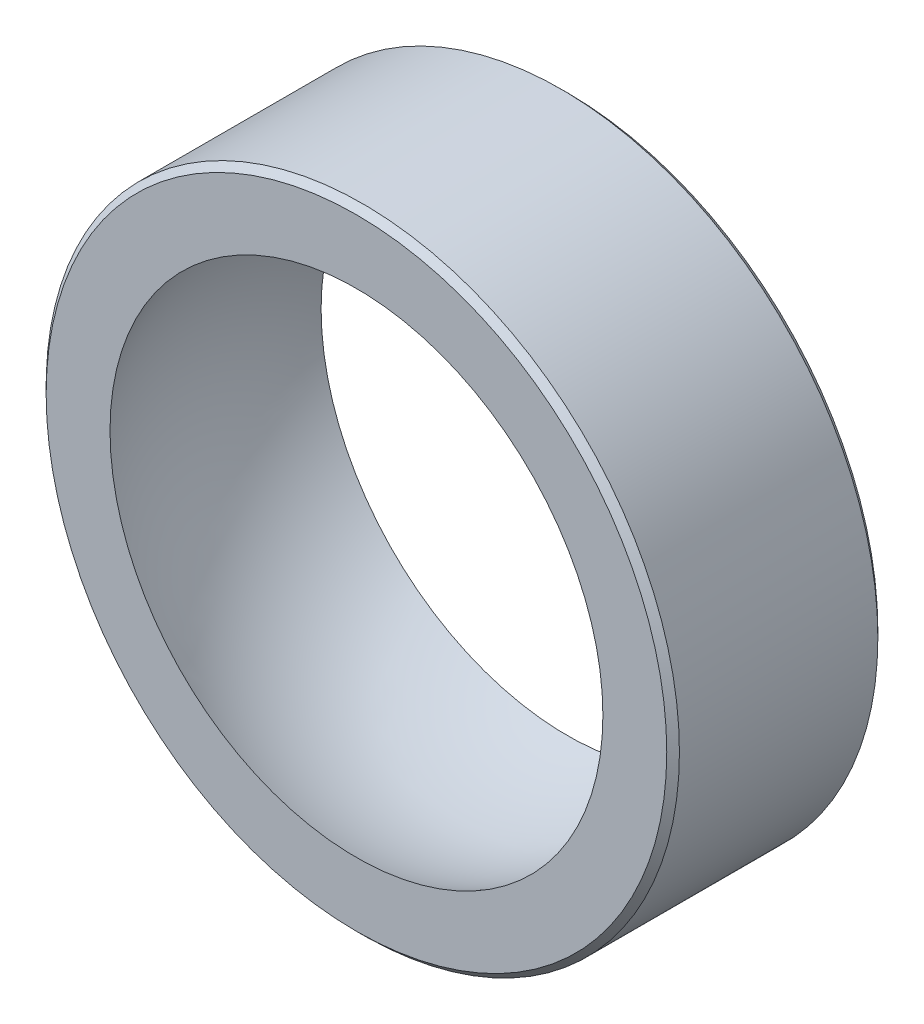
ISO-10303-21;
HEADER;
FILE_DESCRIPTION(('STEP AP214'),'2;1');
FILE_NAME('part.step','',(''),(''),'','','');
FILE_SCHEMA(('AUTOMOTIVE_DESIGN { 1 0 10303 214 1 1 1 1 }'));
ENDSEC;
DATA;
#1=APPLICATION_CONTEXT('core data for automotive mechanical design processes');
#2=APPLICATION_PROTOCOL_DEFINITION('international standard','automotive_design',2000,#1);
#3=PRODUCT_CONTEXT('',#1,'mechanical');
#4=PRODUCT('Part','Part','',(#3));
#5=PRODUCT_RELATED_PRODUCT_CATEGORY('part','',(#4));
#6=PRODUCT_DEFINITION_FORMATION('','',#4);
#7=PRODUCT_DEFINITION_CONTEXT('part definition',#1,'design');
#8=PRODUCT_DEFINITION('design','',#6,#7);
#9=PRODUCT_DEFINITION_SHAPE('','',#8);
#10=(LENGTH_UNIT() NAMED_UNIT(*) SI_UNIT(.MILLI.,.METRE.));
#11=(NAMED_UNIT(*) PLANE_ANGLE_UNIT() SI_UNIT($,.RADIAN.));
#12=(NAMED_UNIT(*) SI_UNIT($,.STERADIAN.) SOLID_ANGLE_UNIT());
#13=UNCERTAINTY_MEASURE_WITH_UNIT(LENGTH_MEASURE(1.E-05),#10,'distance_accuracy_value','');
#14=(GEOMETRIC_REPRESENTATION_CONTEXT(3) GLOBAL_UNCERTAINTY_ASSIGNED_CONTEXT((#13)) GLOBAL_UNIT_ASSIGNED_CONTEXT((#10,
#11,#12)) REPRESENTATION_CONTEXT('',''));
#15=CARTESIAN_POINT('',(0.,0.,0.));
#16=DIRECTION('',(0.,0.,1.));
#17=DIRECTION('',(1.,0.,0.));
#18=AXIS2_PLACEMENT_3D('',#15,#16,#17);
#19=CARTESIAN_POINT('',(0.,0.,-5.));
#20=DIRECTION('',(0.,0.,1.));
#21=DIRECTION('',(1.,0.,0.));
#22=AXIS2_PLACEMENT_3D('',#19,#20,#21);
#23=CYLINDRICAL_SURFACE('',#22,15.);
#24=CARTESIAN_POINT('',(0.,0.,-4.7));
#25=DIRECTION('',(0.,0.,1.));
#26=DIRECTION('',(1.,0.,0.));
#27=AXIS2_PLACEMENT_3D('',#24,#25,#26);
#28=CIRCLE('',#27,15.);
#29=CARTESIAN_POINT('',(15.,0.,-4.7));
#30=VERTEX_POINT('',#29);
#31=EDGE_CURVE('E49',#30,#30,#28,.T.);
#32=ORIENTED_EDGE('',*,*,#31,.T.);
#33=EDGE_LOOP('',(#32));
#34=FACE_BOUND('',#33,.T.);
#35=CARTESIAN_POINT('',(0.,0.,4.69999999999999));
#36=DIRECTION('',(0.,0.,1.));
#37=DIRECTION('',(1.,0.,0.));
#38=AXIS2_PLACEMENT_3D('',#35,#36,#37);
#39=CIRCLE('',#38,15.);
#40=CARTESIAN_POINT('',(15.,0.,4.69999999999999));
#41=VERTEX_POINT('',#40);
#42=EDGE_CURVE('E53',#41,#41,#39,.F.);
#43=ORIENTED_EDGE('',*,*,#42,.T.);
#44=EDGE_LOOP('',(#43));
#45=FACE_BOUND('',#44,.T.);
#46=ADVANCED_FACE('F38',(#34,#45),#23,.T.);
#47=CARTESIAN_POINT('',(0.,0.,-5.));
#48=DIRECTION('',(0.,0.,1.));
#49=DIRECTION('',(1.,0.,0.));
#50=AXIS2_PLACEMENT_3D('',#47,#48,#49);
#51=PLANE('',#50);
#52=CARTESIAN_POINT('',(0.,0.,-5.));
#53=DIRECTION('',(0.,0.,1.));
#54=DIRECTION('',(1.,0.,0.));
#55=AXIS2_PLACEMENT_3D('',#52,#53,#54);
#56=CIRCLE('',#55,11.6743308159397);
#57=CARTESIAN_POINT('',(11.6743308159397,0.,-5.));
#58=VERTEX_POINT('',#57);
#59=EDGE_CURVE('E58',#58,#58,#56,.T.);
#60=ORIENTED_EDGE('',*,*,#59,.T.);
#61=EDGE_LOOP('',(#60));
#62=FACE_BOUND('',#61,.T.);
#63=CARTESIAN_POINT('',(0.,0.,-5.));
#64=DIRECTION('',(0.,0.,1.));
#65=DIRECTION('',(1.,0.,0.));
#66=AXIS2_PLACEMENT_3D('',#63,#64,#65);
#67=CIRCLE('',#66,14.7);
#68=CARTESIAN_POINT('',(14.7,0.,-5.));
#69=VERTEX_POINT('',#68);
#70=EDGE_CURVE('E45',#69,#69,#67,.F.);
#71=ORIENTED_EDGE('',*,*,#70,.T.);
#72=EDGE_LOOP('',(#71));
#73=FACE_BOUND('',#72,.T.);
#74=ADVANCED_FACE('F71',(#62,#73),#51,.F.);
#75=CARTESIAN_POINT('',(0.,0.,5.));
#76=DIRECTION('',(0.,0.,1.));
#77=DIRECTION('',(1.,0.,0.));
#78=AXIS2_PLACEMENT_3D('',#75,#76,#77);
#79=PLANE('',#78);
#80=CARTESIAN_POINT('',(0.,0.,5.));
#81=DIRECTION('',(0.,0.,1.));
#82=DIRECTION('',(1.,0.,0.));
#83=AXIS2_PLACEMENT_3D('',#80,#81,#82);
#84=CIRCLE('',#83,11.6743308159397);
#85=CARTESIAN_POINT('',(11.6743308159397,0.,5.));
#86=VERTEX_POINT('',#85);
#87=EDGE_CURVE('E61',#86,#86,#84,.T.);
#88=ORIENTED_EDGE('',*,*,#87,.F.);
#89=EDGE_LOOP('',(#88));
#90=FACE_BOUND('',#89,.T.);
#91=CARTESIAN_POINT('',(0.,0.,5.));
#92=DIRECTION('',(0.,0.,1.));
#93=DIRECTION('',(1.,0.,0.));
#94=AXIS2_PLACEMENT_3D('',#91,#92,#93);
#95=CIRCLE('',#94,14.7);
#96=CARTESIAN_POINT('',(14.7,0.,5.));
#97=VERTEX_POINT('',#96);
#98=EDGE_CURVE('E10',#97,#97,#95,.T.);
#99=ORIENTED_EDGE('',*,*,#98,.T.);
#100=EDGE_LOOP('',(#99));
#101=FACE_BOUND('',#100,.T.);
#102=ADVANCED_FACE('F68',(#90,#101),#79,.T.);
#103=CARTESIAN_POINT('',(0.,0.,-4.7));
#104=DIRECTION('',(0.,0.,1.));
#105=DIRECTION('',(1.,0.,0.));
#106=AXIS2_PLACEMENT_3D('',#103,#104,#105);
#107=CONICAL_SURFACE('',#106,15.,0.785398163397451);
#108=ORIENTED_EDGE('',*,*,#70,.F.);
#109=EDGE_LOOP('',(#108));
#110=FACE_BOUND('',#109,.T.);
#111=ORIENTED_EDGE('',*,*,#31,.F.);
#112=EDGE_LOOP('',(#111));
#113=FACE_BOUND('',#112,.T.);
#114=ADVANCED_FACE('F70',(#110,#113),#107,.T.);
#115=CARTESIAN_POINT('',(0.,0.,5.));
#116=DIRECTION('',(0.,0.,-1.));
#117=DIRECTION('',(-1.,0.,0.));
#118=AXIS2_PLACEMENT_3D('',#115,#116,#117);
#119=CONICAL_SURFACE('',#118,14.7,0.78539816339744);
#120=ORIENTED_EDGE('',*,*,#42,.F.);
#121=EDGE_LOOP('',(#120));
#122=FACE_BOUND('',#121,.T.);
#123=ORIENTED_EDGE('',*,*,#98,.F.);
#124=EDGE_LOOP('',(#123));
#125=FACE_BOUND('',#124,.T.);
#126=ADVANCED_FACE('F40',(#122,#125),#119,.T.);
#127=CARTESIAN_POINT('',(0.,0.,0.));
#128=DIRECTION('',(0.,0.,-1.));
#129=DIRECTION('',(0.,1.,0.));
#130=AXIS2_PLACEMENT_3D('',#127,#128,#129);
#131=SPHERICAL_SURFACE('',#130,12.7);
#132=ORIENTED_EDGE('',*,*,#87,.T.);
#133=EDGE_LOOP('',(#132));
#134=FACE_BOUND('',#133,.T.);
#135=ORIENTED_EDGE('',*,*,#59,.F.);
#136=EDGE_LOOP('',(#135));
#137=FACE_BOUND('',#136,.T.);
#138=ADVANCED_FACE('F65',(#134,#137),#131,.F.);
#139=CLOSED_SHELL('',(#46,#74,#102,#114,#126,#138));
#140=MANIFOLD_SOLID_BREP('B2',#139);
#141=ADVANCED_BREP_SHAPE_REPRESENTATION('',(#18,#140),#14);
#142=SHAPE_DEFINITION_REPRESENTATION(#9,#141);
ENDSEC;
END-ISO-10303-21;
